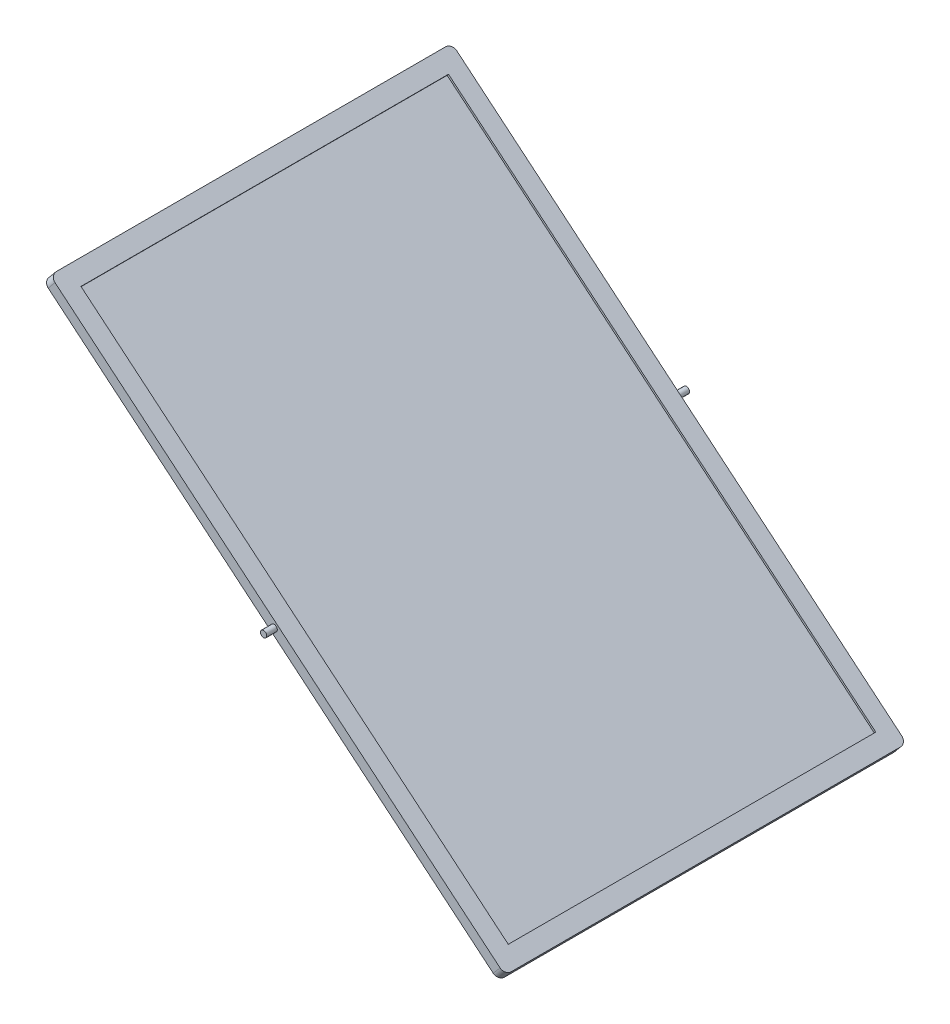
ISO-10303-21;
HEADER;
FILE_DESCRIPTION(('STEP AP214'),'2;1');
FILE_NAME('part.step','',(''),(''),'','','');
FILE_SCHEMA(('AUTOMOTIVE_DESIGN { 1 0 10303 214 1 1 1 1 }'));
ENDSEC;
DATA;
#1=APPLICATION_CONTEXT('core data for automotive mechanical design processes');
#2=APPLICATION_PROTOCOL_DEFINITION('international standard','automotive_design',2000,#1);
#3=PRODUCT_CONTEXT('',#1,'mechanical');
#4=PRODUCT('Part','Part','',(#3));
#5=PRODUCT_RELATED_PRODUCT_CATEGORY('part','',(#4));
#6=PRODUCT_DEFINITION_FORMATION('','',#4);
#7=PRODUCT_DEFINITION_CONTEXT('part definition',#1,'design');
#8=PRODUCT_DEFINITION('design','',#6,#7);
#9=PRODUCT_DEFINITION_SHAPE('','',#8);
#10=(LENGTH_UNIT() NAMED_UNIT(*) SI_UNIT(.MILLI.,.METRE.));
#11=(NAMED_UNIT(*) PLANE_ANGLE_UNIT() SI_UNIT($,.RADIAN.));
#12=(NAMED_UNIT(*) SI_UNIT($,.STERADIAN.) SOLID_ANGLE_UNIT());
#13=UNCERTAINTY_MEASURE_WITH_UNIT(LENGTH_MEASURE(1.E-05),#10,'distance_accuracy_value','');
#14=(GEOMETRIC_REPRESENTATION_CONTEXT(3) GLOBAL_UNCERTAINTY_ASSIGNED_CONTEXT((#13)) GLOBAL_UNIT_ASSIGNED_CONTEXT((#10,
#11,#12)) REPRESENTATION_CONTEXT('',''));
#15=CARTESIAN_POINT('',(0.,0.,0.));
#16=DIRECTION('',(0.,0.,1.));
#17=DIRECTION('',(1.,0.,0.));
#18=AXIS2_PLACEMENT_3D('',#15,#16,#17);
#19=CARTESIAN_POINT('',(207.249971381066,-156.668054291584,190.));
#20=DIRECTION('',(-0.64018439966448,-0.768221279597376,0.));
#21=DIRECTION('',(0.768221279597376,-0.64018439966448,0.));
#22=AXIS2_PLACEMENT_3D('',#19,#20,#21);
#23=PLANE('',#22);
#24=DIRECTION('',(0.768221279597376,-0.64018439966448,0.));
#25=VECTOR('',#24,1.);
#26=CARTESIAN_POINT('',(-1.35138244916978,17.1664072336127,181.912902628911));
#27=LINE('',#26,#25);
#28=CARTESIAN_POINT('',(-1.35138244916977,17.1664072336127,181.912902628911));
#29=VERTEX_POINT('',#28);
#30=CARTESIAN_POINT('',(200.749366924036,-151.250883910726,181.912902628911));
#31=VERTEX_POINT('',#30);
#32=EDGE_CURVE('E174',#29,#31,#27,.T.);
#33=ORIENTED_EDGE('',*,*,#32,.F.);
#34=DIRECTION('',(0.,0.,1.));
#35=VECTOR('',#34,1.);
#36=CARTESIAN_POINT('',(-1.35138244916978,17.1664072336127,8.08709737108865));
#37=LINE('',#36,#35);
#38=CARTESIAN_POINT('',(-1.35138244916978,17.1664072336127,8.08709737108865));
#39=VERTEX_POINT('',#38);
#40=EDGE_CURVE('E59',#39,#29,#37,.T.);
#41=ORIENTED_EDGE('',*,*,#40,.F.);
#42=DIRECTION('',(-0.768221279597376,0.64018439966448,0.));
#43=VECTOR('',#42,1.);
#44=CARTESIAN_POINT('',(-1.35138244916978,17.1664072336127,8.08709737108865));
#45=LINE('',#44,#43);
#46=CARTESIAN_POINT('',(200.749366924036,-151.250883910726,8.08709737108861));
#47=VERTEX_POINT('',#46);
#48=EDGE_CURVE('E158',#47,#39,#45,.T.);
#49=ORIENTED_EDGE('',*,*,#48,.F.);
#50=DIRECTION('',(0.,0.,-1.));
#51=VECTOR('',#50,1.);
#52=CARTESIAN_POINT('',(200.749366924036,-151.250883910726,8.08709737108861));
#53=LINE('',#52,#51);
#54=EDGE_CURVE('E162',#31,#47,#53,.T.);
#55=ORIENTED_EDGE('',*,*,#54,.F.);
#56=EDGE_LOOP('',(#33,#41,#49,#55));
#57=FACE_BOUND('',#56,.T.);
#58=DIRECTION('',(-0.768221279597376,0.64018439966448,0.));
#59=VECTOR('',#58,1.);
#60=CARTESIAN_POINT('',(207.249971381066,-156.668054291584,0.));
#61=LINE('',#60,#59);
#62=CARTESIAN_POINT('',(204.945307542274,-154.74750109259,0.));
#63=VERTEX_POINT('',#62);
#64=CARTESIAN_POINT('',(-5.54732306740732,20.6630244154773,0.));
#65=VERTEX_POINT('',#64);
#66=EDGE_CURVE('E183',#63,#65,#61,.T.);
#67=ORIENTED_EDGE('',*,*,#66,.T.);
#68=CARTESIAN_POINT('',(-5.54732306740728,20.6630244154773,3.));
#69=DIRECTION('',(-0.64018439966448,-0.768221279597376,0.));
#70=DIRECTION('',(0.768221279597376,-0.64018439966448,0.));
#71=AXIS2_PLACEMENT_3D('',#68,#69,#70);
#72=CIRCLE('',#71,3.);
#73=CARTESIAN_POINT('',(-7.85198690619944,22.5835776144707,3.));
#74=VERTEX_POINT('',#73);
#75=EDGE_CURVE('E52',#65,#74,#72,.F.);
#76=ORIENTED_EDGE('',*,*,#75,.T.);
#77=DIRECTION('',(0.,0.,-1.));
#78=VECTOR('',#77,1.);
#79=CARTESIAN_POINT('',(-7.85198690619944,22.5835776144707,190.));
#80=LINE('',#79,#78);
#81=CARTESIAN_POINT('',(-7.85198690619944,22.5835776144707,187.));
#82=VERTEX_POINT('',#81);
#83=EDGE_CURVE('E211',#82,#74,#80,.T.);
#84=ORIENTED_EDGE('',*,*,#83,.F.);
#85=CARTESIAN_POINT('',(-5.54732306740729,20.6630244154772,187.));
#86=DIRECTION('',(-0.64018439966448,-0.768221279597376,0.));
#87=DIRECTION('',(0.768221279597376,-0.64018439966448,0.));
#88=AXIS2_PLACEMENT_3D('',#85,#86,#87);
#89=CIRCLE('',#88,3.);
#90=CARTESIAN_POINT('',(-5.54732306740732,20.6630244154773,190.));
#91=VERTEX_POINT('',#90);
#92=EDGE_CURVE('E254',#82,#91,#89,.F.);
#93=ORIENTED_EDGE('',*,*,#92,.T.);
#94=DIRECTION('',(-0.768221279597376,0.64018439966448,0.));
#95=VECTOR('',#94,1.);
#96=CARTESIAN_POINT('',(207.249971381066,-156.668054291584,190.));
#97=LINE('',#96,#95);
#98=CARTESIAN_POINT('',(204.945307542274,-154.74750109259,190.));
#99=VERTEX_POINT('',#98);
#100=EDGE_CURVE('E189',#99,#91,#97,.T.);
#101=ORIENTED_EDGE('',*,*,#100,.F.);
#102=CARTESIAN_POINT('',(204.945307542274,-154.74750109259,187.));
#103=DIRECTION('',(-0.64018439966448,-0.768221279597376,0.));
#104=DIRECTION('',(0.768221279597376,-0.64018439966448,0.));
#105=AXIS2_PLACEMENT_3D('',#102,#103,#104);
#106=CIRCLE('',#105,3.);
#107=CARTESIAN_POINT('',(207.249971381066,-156.668054291584,187.));
#108=VERTEX_POINT('',#107);
#109=EDGE_CURVE('E234',#99,#108,#106,.F.);
#110=ORIENTED_EDGE('',*,*,#109,.T.);
#111=DIRECTION('',(0.,0.,-1.));
#112=VECTOR('',#111,1.);
#113=CARTESIAN_POINT('',(207.249971381066,-156.668054291584,190.));
#114=LINE('',#113,#112);
#115=CARTESIAN_POINT('',(207.249971381066,-156.668054291584,3.));
#116=VERTEX_POINT('',#115);
#117=EDGE_CURVE('E197',#108,#116,#114,.T.);
#118=ORIENTED_EDGE('',*,*,#117,.T.);
#119=CARTESIAN_POINT('',(204.945307542274,-154.74750109259,3.));
#120=DIRECTION('',(-0.64018439966448,-0.768221279597376,0.));
#121=DIRECTION('',(0.768221279597376,-0.64018439966448,0.));
#122=AXIS2_PLACEMENT_3D('',#119,#120,#121);
#123=CIRCLE('',#122,3.);
#124=EDGE_CURVE('E219',#116,#63,#123,.F.);
#125=ORIENTED_EDGE('',*,*,#124,.T.);
#126=EDGE_LOOP('',(#67,#76,#84,#93,#101,#110,#118,#125));
#127=FACE_BOUND('',#126,.T.);
#128=ADVANCED_FACE('F43',(#57,#127),#23,.F.);
#129=CARTESIAN_POINT('',(-7.85198690619944,22.5835776144707,190.));
#130=DIRECTION('',(0.768221279597376,-0.64018439966448,0.));
#131=DIRECTION('',(0.64018439966448,0.768221279597376,0.));
#132=AXIS2_PLACEMENT_3D('',#129,#130,#131);
#133=PLANE('',#132);
#134=ORIENTED_EDGE('',*,*,#83,.T.);
#135=DIRECTION('',(-0.64018439966448,-0.768221279597376,0.));
#136=VECTOR('',#135,1.);
#137=CARTESIAN_POINT('',(-7.85198690619944,22.5835776144707,3.));
#138=LINE('',#137,#136);
#139=CARTESIAN_POINT('',(-11.0529089045218,18.7424712164838,3.));
#140=VERTEX_POINT('',#139);
#141=EDGE_CURVE('E257',#74,#140,#138,.T.);
#142=ORIENTED_EDGE('',*,*,#141,.T.);
#143=DIRECTION('',(0.,0.,-1.));
#144=VECTOR('',#143,1.);
#145=CARTESIAN_POINT('',(-11.0529089045218,18.7424712164838,190.));
#146=LINE('',#145,#144);
#147=CARTESIAN_POINT('',(-11.0529089045218,18.7424712164838,187.));
#148=VERTEX_POINT('',#147);
#149=EDGE_CURVE('E207',#148,#140,#146,.T.);
#150=ORIENTED_EDGE('',*,*,#149,.F.);
#151=DIRECTION('',(-0.64018439966448,-0.768221279597376,0.));
#152=VECTOR('',#151,1.);
#153=CARTESIAN_POINT('',(-7.85198690619944,22.5835776144707,187.));
#154=LINE('',#153,#152);
#155=EDGE_CURVE('E251',#148,#82,#154,.F.);
#156=ORIENTED_EDGE('',*,*,#155,.T.);
#157=EDGE_LOOP('',(#134,#142,#150,#156));
#158=FACE_BOUND('',#157,.T.);
#159=ADVANCED_FACE('F273',(#158),#133,.F.);
#160=CARTESIAN_POINT('',(-11.0529089045218,18.7424712164838,190.));
#161=DIRECTION('',(0.64018439966448,0.768221279597376,0.));
#162=DIRECTION('',(-0.768221279597376,0.64018439966448,0.));
#163=AXIS2_PLACEMENT_3D('',#160,#161,#162);
#164=PLANE('',#163);
#165=ORIENTED_EDGE('',*,*,#149,.T.);
#166=CARTESIAN_POINT('',(-8.74824506572972,16.8219180174903,3.));
#167=DIRECTION('',(0.64018439966448,0.768221279597376,0.));
#168=DIRECTION('',(-0.768221279597376,0.64018439966448,0.));
#169=AXIS2_PLACEMENT_3D('',#166,#167,#168);
#170=CIRCLE('',#169,3.);
#171=CARTESIAN_POINT('',(-8.74824506572972,16.8219180174903,0.));
#172=VERTEX_POINT('',#171);
#173=EDGE_CURVE('E261',#140,#172,#170,.F.);
#174=ORIENTED_EDGE('',*,*,#173,.T.);
#175=DIRECTION('',(0.768221279597376,-0.64018439966448,0.));
#176=VECTOR('',#175,1.);
#177=CARTESIAN_POINT('',(-11.0529089045218,18.7424712164838,0.));
#178=LINE('',#177,#176);
#179=CARTESIAN_POINT('',(201.744385543951,-158.588607490577,0.));
#180=VERTEX_POINT('',#179);
#181=EDGE_CURVE('E194',#172,#180,#178,.T.);
#182=ORIENTED_EDGE('',*,*,#181,.T.);
#183=CARTESIAN_POINT('',(201.744385543951,-158.588607490577,3.));
#184=DIRECTION('',(0.64018439966448,0.768221279597376,0.));
#185=DIRECTION('',(-0.768221279597376,0.64018439966448,0.));
#186=AXIS2_PLACEMENT_3D('',#183,#184,#185);
#187=CIRCLE('',#186,3.);
#188=CARTESIAN_POINT('',(204.049049382743,-160.509160689571,3.));
#189=VERTEX_POINT('',#188);
#190=EDGE_CURVE('E226',#180,#189,#187,.F.);
#191=ORIENTED_EDGE('',*,*,#190,.T.);
#192=DIRECTION('',(0.,0.,-1.));
#193=VECTOR('',#192,1.);
#194=CARTESIAN_POINT('',(204.049049382743,-160.509160689571,190.));
#195=LINE('',#194,#193);
#196=CARTESIAN_POINT('',(204.049049382743,-160.509160689571,187.));
#197=VERTEX_POINT('',#196);
#198=EDGE_CURVE('E204',#197,#189,#195,.T.);
#199=ORIENTED_EDGE('',*,*,#198,.F.);
#200=CARTESIAN_POINT('',(201.744385543951,-158.588607490577,187.));
#201=DIRECTION('',(0.64018439966448,0.768221279597376,0.));
#202=DIRECTION('',(-0.768221279597376,0.64018439966448,0.));
#203=AXIS2_PLACEMENT_3D('',#200,#201,#202);
#204=CIRCLE('',#203,3.);
#205=CARTESIAN_POINT('',(201.744385543951,-158.588607490577,190.));
#206=VERTEX_POINT('',#205);
#207=EDGE_CURVE('E240',#197,#206,#204,.F.);
#208=ORIENTED_EDGE('',*,*,#207,.T.);
#209=DIRECTION('',(0.768221279597376,-0.64018439966448,0.));
#210=VECTOR('',#209,1.);
#211=CARTESIAN_POINT('',(-11.0529089045218,18.7424712164838,190.));
#212=LINE('',#211,#210);
#213=CARTESIAN_POINT('',(-8.74824506572972,16.8219180174903,190.));
#214=VERTEX_POINT('',#213);
#215=EDGE_CURVE('E193',#214,#206,#212,.T.);
#216=ORIENTED_EDGE('',*,*,#215,.F.);
#217=CARTESIAN_POINT('',(-8.74824506572972,16.8219180174903,187.));
#218=DIRECTION('',(0.64018439966448,0.768221279597376,0.));
#219=DIRECTION('',(-0.768221279597376,0.64018439966448,0.));
#220=AXIS2_PLACEMENT_3D('',#217,#218,#219);
#221=CIRCLE('',#220,3.);
#222=EDGE_CURVE('E248',#214,#148,#221,.F.);
#223=ORIENTED_EDGE('',*,*,#222,.T.);
#224=EDGE_LOOP('',(#165,#174,#182,#191,#199,#208,#216,#223));
#225=FACE_BOUND('',#224,.T.);
#226=ADVANCED_FACE('F277',(#225),#164,.F.);
#227=CARTESIAN_POINT('',(204.049049382743,-160.509160689571,190.));
#228=DIRECTION('',(-0.768221279597376,0.64018439966448,0.));
#229=DIRECTION('',(-0.64018439966448,-0.768221279597376,0.));
#230=AXIS2_PLACEMENT_3D('',#227,#228,#229);
#231=PLANE('',#230);
#232=ORIENTED_EDGE('',*,*,#117,.F.);
#233=DIRECTION('',(0.64018439966448,0.768221279597376,0.));
#234=VECTOR('',#233,1.);
#235=CARTESIAN_POINT('',(204.049049382743,-160.509160689571,187.));
#236=LINE('',#235,#234);
#237=EDGE_CURVE('E237',#108,#197,#236,.F.);
#238=ORIENTED_EDGE('',*,*,#237,.T.);
#239=ORIENTED_EDGE('',*,*,#198,.T.);
#240=DIRECTION('',(0.64018439966448,0.768221279597376,0.));
#241=VECTOR('',#240,1.);
#242=CARTESIAN_POINT('',(204.049049382743,-160.509160689571,3.));
#243=LINE('',#242,#241);
#244=EDGE_CURVE('E215',#189,#116,#243,.T.);
#245=ORIENTED_EDGE('',*,*,#244,.T.);
#246=EDGE_LOOP('',(#232,#238,#239,#245));
#247=FACE_BOUND('',#246,.T.);
#248=ADVANCED_FACE('F324',(#247),#231,.F.);
#249=CARTESIAN_POINT('',(0.,0.,190.));
#250=DIRECTION('',(0.,0.,1.));
#251=DIRECTION('',(1.,0.,0.));
#252=AXIS2_PLACEMENT_3D('',#249,#250,#251);
#253=PLANE('',#252);
#254=CARTESIAN_POINT('',(98.0985312382719,-68.96279153755,190.));
#255=DIRECTION('',(0.,0.,1.));
#256=DIRECTION('',(1.,0.,0.));
#257=AXIS2_PLACEMENT_3D('',#254,#255,#256);
#258=CIRCLE('',#257,1.5);
#259=CARTESIAN_POINT('',(99.5985312382719,-68.96279153755,190.));
#260=VERTEX_POINT('',#259);
#261=EDGE_CURVE('E490',#260,#260,#258,.T.);
#262=ORIENTED_EDGE('',*,*,#261,.F.);
#263=EDGE_LOOP('',(#262));
#264=FACE_BOUND('',#263,.T.);
#265=ORIENTED_EDGE('',*,*,#100,.T.);
#266=DIRECTION('',(-0.64018439966448,-0.768221279597376,0.));
#267=VECTOR('',#266,1.);
#268=CARTESIAN_POINT('',(-8.74824506572972,16.8219180174903,190.));
#269=LINE('',#268,#267);
#270=EDGE_CURVE('E244',#91,#214,#269,.T.);
#271=ORIENTED_EDGE('',*,*,#270,.T.);
#272=ORIENTED_EDGE('',*,*,#215,.T.);
#273=DIRECTION('',(0.64018439966448,0.768221279597376,0.));
#274=VECTOR('',#273,1.);
#275=CARTESIAN_POINT('',(204.945307542274,-154.74750109259,190.));
#276=LINE('',#275,#274);
#277=EDGE_CURVE('E230',#206,#99,#276,.T.);
#278=ORIENTED_EDGE('',*,*,#277,.T.);
#279=EDGE_LOOP('',(#265,#271,#272,#278));
#280=FACE_BOUND('',#279,.T.);
#281=ADVANCED_FACE('F295',(#264,#280),#253,.T.);
#282=CARTESIAN_POINT('',(0.,0.,0.));
#283=DIRECTION('',(0.,0.,1.));
#284=DIRECTION('',(1.,0.,0.));
#285=AXIS2_PLACEMENT_3D('',#282,#283,#284);
#286=PLANE('',#285);
#287=CARTESIAN_POINT('',(98.098531238272,-68.96279153755,0.));
#288=DIRECTION('',(0.,0.,1.));
#289=DIRECTION('',(1.,0.,0.));
#290=AXIS2_PLACEMENT_3D('',#287,#288,#289);
#291=CIRCLE('',#290,1.5);
#292=CARTESIAN_POINT('',(99.598531238272,-68.96279153755,0.));
#293=VERTEX_POINT('',#292);
#294=EDGE_CURVE('E11',#293,#293,#291,.F.);
#295=ORIENTED_EDGE('',*,*,#294,.F.);
#296=EDGE_LOOP('',(#295));
#297=FACE_BOUND('',#296,.T.);
#298=ORIENTED_EDGE('',*,*,#181,.F.);
#299=DIRECTION('',(-0.64018439966448,-0.768221279597376,0.));
#300=VECTOR('',#299,1.);
#301=CARTESIAN_POINT('',(-13.4359731621472,11.1966443017893,0.));
#302=LINE('',#301,#300);
#303=EDGE_CURVE('E67',#172,#65,#302,.F.);
#304=ORIENTED_EDGE('',*,*,#303,.T.);
#305=ORIENTED_EDGE('',*,*,#66,.F.);
#306=DIRECTION('',(0.64018439966448,0.768221279597376,0.));
#307=VECTOR('',#306,1.);
#308=CARTESIAN_POINT('',(197.056657447534,-164.213881206278,0.));
#309=LINE('',#308,#307);
#310=EDGE_CURVE('E222',#63,#180,#309,.F.);
#311=ORIENTED_EDGE('',*,*,#310,.T.);
#312=EDGE_LOOP('',(#298,#304,#305,#311));
#313=FACE_BOUND('',#312,.T.);
#314=ADVANCED_FACE('F278',(#297,#313),#286,.F.);
#315=CARTESIAN_POINT('',(201.744385543951,-158.588607490577,3.));
#316=DIRECTION('',(0.64018439966448,0.768221279597376,0.));
#317=DIRECTION('',(-0.768221279597376,0.64018439966448,0.));
#318=AXIS2_PLACEMENT_3D('',#315,#316,#317);
#319=CYLINDRICAL_SURFACE('',#318,3.);
#320=ORIENTED_EDGE('',*,*,#190,.F.);
#321=ORIENTED_EDGE('',*,*,#310,.F.);
#322=ORIENTED_EDGE('',*,*,#124,.F.);
#323=ORIENTED_EDGE('',*,*,#244,.F.);
#324=EDGE_LOOP('',(#320,#321,#322,#323));
#325=FACE_BOUND('',#324,.T.);
#326=ADVANCED_FACE('F284',(#325),#319,.T.);
#327=CARTESIAN_POINT('',(197.056657447534,-164.213881206278,187.));
#328=DIRECTION('',(-0.64018439966448,-0.768221279597376,0.));
#329=DIRECTION('',(0.768221279597376,-0.64018439966448,0.));
#330=AXIS2_PLACEMENT_3D('',#327,#328,#329);
#331=CYLINDRICAL_SURFACE('',#330,3.);
#332=ORIENTED_EDGE('',*,*,#207,.F.);
#333=ORIENTED_EDGE('',*,*,#237,.F.);
#334=ORIENTED_EDGE('',*,*,#109,.F.);
#335=ORIENTED_EDGE('',*,*,#277,.F.);
#336=EDGE_LOOP('',(#332,#333,#334,#335));
#337=FACE_BOUND('',#336,.T.);
#338=ADVANCED_FACE('F292',(#337),#331,.T.);
#339=CARTESIAN_POINT('',(-13.4359731621472,11.1966443017893,187.));
#340=DIRECTION('',(0.64018439966448,0.768221279597376,0.));
#341=DIRECTION('',(-0.768221279597376,0.64018439966448,0.));
#342=AXIS2_PLACEMENT_3D('',#339,#340,#341);
#343=CYLINDRICAL_SURFACE('',#342,3.);
#344=ORIENTED_EDGE('',*,*,#92,.F.);
#345=ORIENTED_EDGE('',*,*,#155,.F.);
#346=ORIENTED_EDGE('',*,*,#222,.F.);
#347=ORIENTED_EDGE('',*,*,#270,.F.);
#348=EDGE_LOOP('',(#344,#345,#346,#347));
#349=FACE_BOUND('',#348,.T.);
#350=ADVANCED_FACE('F299',(#349),#343,.T.);
#351=CARTESIAN_POINT('',(-5.54732306740731,20.6630244154772,3.));
#352=DIRECTION('',(-0.64018439966448,-0.768221279597376,0.));
#353=DIRECTION('',(0.768221279597376,-0.64018439966448,0.));
#354=AXIS2_PLACEMENT_3D('',#351,#352,#353);
#355=CYLINDRICAL_SURFACE('',#354,3.);
#356=ORIENTED_EDGE('',*,*,#75,.F.);
#357=ORIENTED_EDGE('',*,*,#303,.F.);
#358=ORIENTED_EDGE('',*,*,#173,.F.);
#359=ORIENTED_EDGE('',*,*,#141,.F.);
#360=EDGE_LOOP('',(#356,#357,#358,#359));
#361=FACE_BOUND('',#360,.T.);
#362=ADVANCED_FACE('F45',(#361),#355,.T.);
#363=CARTESIAN_POINT('',(-1.99156684883426,16.3981859540153,8.08709737108865));
#364=DIRECTION('',(-0.768221279597376,0.64018439966448,0.));
#365=DIRECTION('',(-0.64018439966448,-0.768221279597376,0.));
#366=AXIS2_PLACEMENT_3D('',#363,#364,#365);
#367=PLANE('',#366);
#368=ORIENTED_EDGE('',*,*,#40,.T.);
#369=DIRECTION('',(0.64018439966448,0.768221279597376,0.));
#370=VECTOR('',#369,1.);
#371=CARTESIAN_POINT('',(-1.99156684883426,16.3981859540153,181.912902628911));
#372=LINE('',#371,#370);
#373=CARTESIAN_POINT('',(-1.99156684883426,16.3981859540153,181.912902628911));
#374=VERTEX_POINT('',#373);
#375=EDGE_CURVE('E133',#374,#29,#372,.T.);
#376=ORIENTED_EDGE('',*,*,#375,.F.);
#377=DIRECTION('',(0.,0.,1.));
#378=VECTOR('',#377,1.);
#379=CARTESIAN_POINT('',(-1.99156684883426,16.3981859540153,8.08709737108865));
#380=LINE('',#379,#378);
#381=CARTESIAN_POINT('',(-1.99156684883426,16.3981859540153,8.08709737108865));
#382=VERTEX_POINT('',#381);
#383=EDGE_CURVE('E137',#382,#374,#380,.T.);
#384=ORIENTED_EDGE('',*,*,#383,.F.);
#385=DIRECTION('',(0.64018439966448,0.768221279597376,0.));
#386=VECTOR('',#385,1.);
#387=CARTESIAN_POINT('',(-1.99156684883426,16.3981859540153,8.08709737108865));
#388=LINE('',#387,#386);
#389=EDGE_CURVE('E180',#382,#39,#388,.T.);
#390=ORIENTED_EDGE('',*,*,#389,.T.);
#391=EDGE_LOOP('',(#368,#376,#384,#390));
#392=FACE_BOUND('',#391,.T.);
#393=ADVANCED_FACE('F135',(#392),#367,.F.);
#394=CARTESIAN_POINT('',(-1.99156684883426,16.3981859540153,8.08709737108865));
#395=DIRECTION('',(0.,0.,-1.));
#396=DIRECTION('',(-1.,0.,0.));
#397=AXIS2_PLACEMENT_3D('',#394,#395,#396);
#398=PLANE('',#397);
#399=ORIENTED_EDGE('',*,*,#48,.T.);
#400=ORIENTED_EDGE('',*,*,#389,.F.);
#401=DIRECTION('',(-0.768221279597376,0.64018439966448,0.));
#402=VECTOR('',#401,1.);
#403=CARTESIAN_POINT('',(-1.99156684883426,16.3981859540153,8.08709737108865));
#404=LINE('',#403,#402);
#405=CARTESIAN_POINT('',(200.109182524372,-152.019105190323,8.08709737108861));
#406=VERTEX_POINT('',#405);
#407=EDGE_CURVE('E144',#406,#382,#404,.T.);
#408=ORIENTED_EDGE('',*,*,#407,.F.);
#409=DIRECTION('',(0.64018439966448,0.768221279597376,0.));
#410=VECTOR('',#409,1.);
#411=CARTESIAN_POINT('',(200.109182524372,-152.019105190323,8.08709737108861));
#412=LINE('',#411,#410);
#413=EDGE_CURVE('E184',#406,#47,#412,.T.);
#414=ORIENTED_EDGE('',*,*,#413,.T.);
#415=EDGE_LOOP('',(#399,#400,#408,#414));
#416=FACE_BOUND('',#415,.T.);
#417=ADVANCED_FACE('F414',(#416),#398,.F.);
#418=CARTESIAN_POINT('',(200.109182524372,-152.019105190323,8.08709737108861));
#419=DIRECTION('',(0.768221279597376,-0.64018439966448,0.));
#420=DIRECTION('',(0.64018439966448,0.768221279597376,0.));
#421=AXIS2_PLACEMENT_3D('',#418,#419,#420);
#422=PLANE('',#421);
#423=ORIENTED_EDGE('',*,*,#54,.T.);
#424=ORIENTED_EDGE('',*,*,#413,.F.);
#425=DIRECTION('',(0.,0.,-1.));
#426=VECTOR('',#425,1.);
#427=CARTESIAN_POINT('',(200.109182524372,-152.019105190323,8.08709737108861));
#428=LINE('',#427,#426);
#429=CARTESIAN_POINT('',(200.109182524372,-152.019105190323,181.912902628911));
#430=VERTEX_POINT('',#429);
#431=EDGE_CURVE('E153',#430,#406,#428,.T.);
#432=ORIENTED_EDGE('',*,*,#431,.F.);
#433=DIRECTION('',(0.64018439966448,0.768221279597376,0.));
#434=VECTOR('',#433,1.);
#435=CARTESIAN_POINT('',(200.109182524372,-152.019105190323,181.912902628911));
#436=LINE('',#435,#434);
#437=EDGE_CURVE('E143',#430,#31,#436,.T.);
#438=ORIENTED_EDGE('',*,*,#437,.T.);
#439=EDGE_LOOP('',(#423,#424,#432,#438));
#440=FACE_BOUND('',#439,.T.);
#441=ADVANCED_FACE('F407',(#440),#422,.F.);
#442=CARTESIAN_POINT('',(-1.99156684883426,16.3981859540153,181.912902628911));
#443=DIRECTION('',(0.,0.,1.));
#444=DIRECTION('',(1.,0.,0.));
#445=AXIS2_PLACEMENT_3D('',#442,#443,#444);
#446=PLANE('',#445);
#447=ORIENTED_EDGE('',*,*,#32,.T.);
#448=ORIENTED_EDGE('',*,*,#437,.F.);
#449=DIRECTION('',(0.768221279597376,-0.64018439966448,0.));
#450=VECTOR('',#449,1.);
#451=CARTESIAN_POINT('',(-1.99156684883426,16.3981859540153,181.912902628911));
#452=LINE('',#451,#450);
#453=EDGE_CURVE('E147',#374,#430,#452,.T.);
#454=ORIENTED_EDGE('',*,*,#453,.F.);
#455=ORIENTED_EDGE('',*,*,#375,.T.);
#456=EDGE_LOOP('',(#447,#448,#454,#455));
#457=FACE_BOUND('',#456,.T.);
#458=ADVANCED_FACE('F148',(#457),#446,.F.);
#459=CARTESIAN_POINT('',(7.24846569507545,8.69815883409053,0.));
#460=DIRECTION('',(0.64018439966448,0.768221279597376,0.));
#461=DIRECTION('',(-0.768221279597376,0.64018439966448,0.));
#462=AXIS2_PLACEMENT_3D('',#459,#460,#461);
#463=PLANE('',#462);
#464=ORIENTED_EDGE('',*,*,#383,.T.);
#465=ORIENTED_EDGE('',*,*,#453,.T.);
#466=ORIENTED_EDGE('',*,*,#431,.T.);
#467=ORIENTED_EDGE('',*,*,#407,.T.);
#468=EDGE_LOOP('',(#464,#465,#466,#467));
#469=FACE_BOUND('',#468,.T.);
#470=ADVANCED_FACE('F155',(#469),#463,.T.);
#471=CARTESIAN_POINT('',(98.098531238272,-68.96279153755,-5.));
#472=DIRECTION('',(0.,0.,1.));
#473=DIRECTION('',(1.,0.,0.));
#474=AXIS2_PLACEMENT_3D('',#471,#472,#473);
#475=CYLINDRICAL_SURFACE('',#474,1.5);
#476=CARTESIAN_POINT('',(98.098531238272,-68.96279153755,-5.));
#477=DIRECTION('',(0.,0.,-1.));
#478=DIRECTION('',(-1.,0.,0.));
#479=AXIS2_PLACEMENT_3D('',#476,#477,#478);
#480=CIRCLE('',#479,1.5);
#481=CARTESIAN_POINT('',(96.598531238272,-68.96279153755,-5.));
#482=VERTEX_POINT('',#481);
#483=EDGE_CURVE('E165',#482,#482,#480,.T.);
#484=ORIENTED_EDGE('',*,*,#483,.F.);
#485=EDGE_LOOP('',(#484));
#486=FACE_BOUND('',#485,.T.);
#487=ORIENTED_EDGE('',*,*,#294,.T.);
#488=EDGE_LOOP('',(#487));
#489=FACE_BOUND('',#488,.T.);
#490=ADVANCED_FACE('F388',(#486,#489),#475,.T.);
#491=CARTESIAN_POINT('',(98.098531238272,-68.96279153755,-5.));
#492=DIRECTION('',(0.,0.,-1.));
#493=DIRECTION('',(-1.,0.,0.));
#494=AXIS2_PLACEMENT_3D('',#491,#492,#493);
#495=PLANE('',#494);
#496=ORIENTED_EDGE('',*,*,#483,.T.);
#497=EDGE_LOOP('',(#496));
#498=FACE_BOUND('',#497,.T.);
#499=ADVANCED_FACE('F353',(#498),#495,.T.);
#500=CARTESIAN_POINT('',(98.0985312382719,-68.96279153755,195.));
#501=DIRECTION('',(0.,0.,-1.));
#502=DIRECTION('',(-1.,0.,0.));
#503=AXIS2_PLACEMENT_3D('',#500,#501,#502);
#504=CYLINDRICAL_SURFACE('',#503,1.5);
#505=CARTESIAN_POINT('',(98.0985312382719,-68.96279153755,195.));
#506=DIRECTION('',(0.,0.,1.));
#507=DIRECTION('',(1.,0.,0.));
#508=AXIS2_PLACEMENT_3D('',#505,#506,#507);
#509=CIRCLE('',#508,1.5);
#510=CARTESIAN_POINT('',(99.5985312382719,-68.96279153755,195.));
#511=VERTEX_POINT('',#510);
#512=EDGE_CURVE('E487',#511,#511,#509,.T.);
#513=ORIENTED_EDGE('',*,*,#512,.F.);
#514=EDGE_LOOP('',(#513));
#515=FACE_BOUND('',#514,.T.);
#516=ORIENTED_EDGE('',*,*,#261,.T.);
#517=EDGE_LOOP('',(#516));
#518=FACE_BOUND('',#517,.T.);
#519=ADVANCED_FACE('F358',(#515,#518),#504,.T.);
#520=CARTESIAN_POINT('',(98.0985312382719,-68.96279153755,195.));
#521=DIRECTION('',(0.,0.,1.));
#522=DIRECTION('',(1.,0.,0.));
#523=AXIS2_PLACEMENT_3D('',#520,#521,#522);
#524=PLANE('',#523);
#525=ORIENTED_EDGE('',*,*,#512,.T.);
#526=EDGE_LOOP('',(#525));
#527=FACE_BOUND('',#526,.T.);
#528=ADVANCED_FACE('F364',(#527),#524,.T.);
#529=CLOSED_SHELL('',(#128,#159,#226,#248,#281,#314,#326,#338,#350,#362,#393,#417,#441,#458,
#470,#490,#499,#519,#528));
#530=MANIFOLD_SOLID_BREP('B2',#529);
#531=ADVANCED_BREP_SHAPE_REPRESENTATION('',(#18,#530),#14);
#532=SHAPE_DEFINITION_REPRESENTATION(#9,#531);
ENDSEC;
END-ISO-10303-21;
